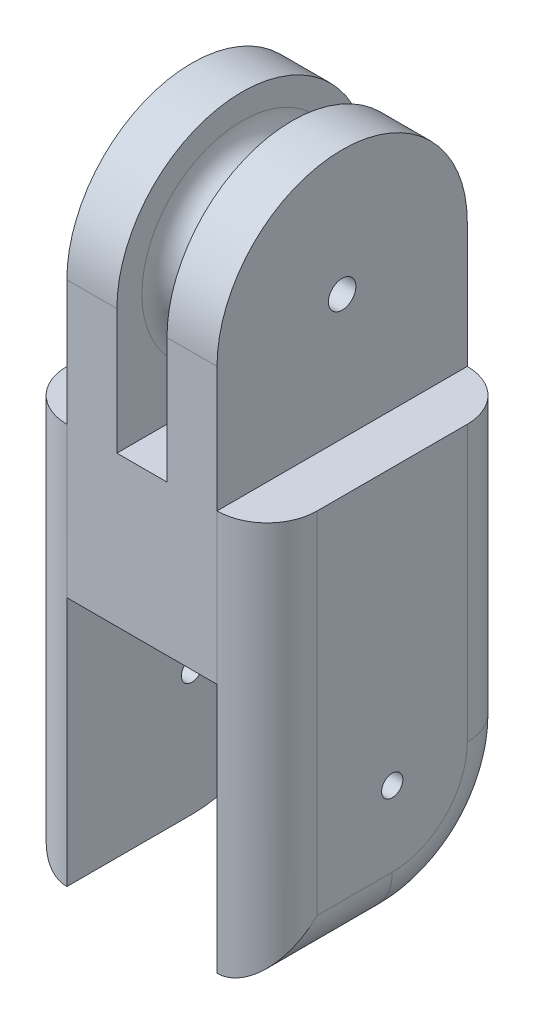
ISO-10303-21;
HEADER;
FILE_DESCRIPTION(('STEP AP214'),'2;1');
FILE_NAME('part.step','',(''),(''),'','','');
FILE_SCHEMA(('AUTOMOTIVE_DESIGN { 1 0 10303 214 1 1 1 1 }'));
ENDSEC;
DATA;
#1=APPLICATION_CONTEXT('core data for automotive mechanical design processes');
#2=APPLICATION_PROTOCOL_DEFINITION('international standard','automotive_design',2000,#1);
#3=PRODUCT_CONTEXT('',#1,'mechanical');
#4=PRODUCT('Part','Part','',(#3));
#5=PRODUCT_RELATED_PRODUCT_CATEGORY('part','',(#4));
#6=PRODUCT_DEFINITION_FORMATION('','',#4);
#7=PRODUCT_DEFINITION_CONTEXT('part definition',#1,'design');
#8=PRODUCT_DEFINITION('design','',#6,#7);
#9=PRODUCT_DEFINITION_SHAPE('','',#8);
#10=(LENGTH_UNIT() NAMED_UNIT(*) SI_UNIT(.MILLI.,.METRE.));
#11=(NAMED_UNIT(*) PLANE_ANGLE_UNIT() SI_UNIT($,.RADIAN.));
#12=(NAMED_UNIT(*) SI_UNIT($,.STERADIAN.) SOLID_ANGLE_UNIT());
#13=UNCERTAINTY_MEASURE_WITH_UNIT(LENGTH_MEASURE(1.E-05),#10,'distance_accuracy_value','');
#14=(GEOMETRIC_REPRESENTATION_CONTEXT(3) GLOBAL_UNCERTAINTY_ASSIGNED_CONTEXT((#13)) GLOBAL_UNIT_ASSIGNED_CONTEXT((#10,
#11,#12)) REPRESENTATION_CONTEXT('',''));
#15=CARTESIAN_POINT('',(0.,0.,0.));
#16=DIRECTION('',(0.,0.,1.));
#17=DIRECTION('',(1.,0.,0.));
#18=AXIS2_PLACEMENT_3D('',#15,#16,#17);
#19=CARTESIAN_POINT('',(0.,12.,0.));
#20=DIRECTION('',(0.,1.,0.));
#21=DIRECTION('',(0.,0.,1.));
#22=AXIS2_PLACEMENT_3D('',#19,#20,#21);
#23=PLANE('',#22);
#24=CARTESIAN_POINT('',(-6.,12.,6.));
#25=DIRECTION('',(0.,1.,0.));
#26=DIRECTION('',(0.,0.,1.));
#27=AXIS2_PLACEMENT_3D('',#24,#25,#26);
#28=CIRCLE('',#27,4.);
#29=CARTESIAN_POINT('',(-10.,12.,6.));
#30=VERTEX_POINT('',#29);
#31=CARTESIAN_POINT('',(-6.,12.,10.));
#32=VERTEX_POINT('',#31);
#33=EDGE_CURVE('E372',#30,#32,#28,.T.);
#34=ORIENTED_EDGE('',*,*,#33,.T.);
#35=DIRECTION('',(0.,0.,1.));
#36=VECTOR('',#35,1.);
#37=CARTESIAN_POINT('',(-6.,12.,10.));
#38=LINE('',#37,#36);
#39=CARTESIAN_POINT('',(-6.,12.,-10.));
#40=VERTEX_POINT('',#39);
#41=EDGE_CURVE('E172',#40,#32,#38,.T.);
#42=ORIENTED_EDGE('',*,*,#41,.F.);
#43=CARTESIAN_POINT('',(-6.,12.,-6.));
#44=DIRECTION('',(0.,1.,0.));
#45=DIRECTION('',(0.,0.,1.));
#46=AXIS2_PLACEMENT_3D('',#43,#44,#45);
#47=CIRCLE('',#46,4.);
#48=CARTESIAN_POINT('',(-10.,12.,-6.));
#49=VERTEX_POINT('',#48);
#50=EDGE_CURVE('E369',#40,#49,#47,.T.);
#51=ORIENTED_EDGE('',*,*,#50,.T.);
#52=DIRECTION('',(0.,0.,1.));
#53=VECTOR('',#52,1.);
#54=CARTESIAN_POINT('',(-10.,12.,-10.));
#55=LINE('',#54,#53);
#56=EDGE_CURVE('E310',#49,#30,#55,.T.);
#57=ORIENTED_EDGE('',*,*,#56,.T.);
#58=EDGE_LOOP('',(#34,#42,#51,#57));
#59=FACE_BOUND('',#58,.T.);
#60=ADVANCED_FACE('F39',(#59),#23,.T.);
#61=CARTESIAN_POINT('',(0.,12.,-6.));
#62=DIRECTION('',(0.,1.,0.));
#63=DIRECTION('',(0.,0.,1.));
#64=AXIS2_PLACEMENT_3D('',#61,#62,#63);
#65=CIRCLE('',#64,0.5);
#66=CARTESIAN_POINT('',(0.,12.,-5.5));
#67=VERTEX_POINT('',#66);
#68=EDGE_CURVE('E426',#67,#67,#65,.F.);
#69=ORIENTED_EDGE('',*,*,#68,.T.);
#70=EDGE_LOOP('',(#69));
#71=FACE_BOUND('',#70,.T.);
#72=CARTESIAN_POINT('',(0.,12.,6.));
#73=DIRECTION('',(0.,1.,0.));
#74=DIRECTION('',(0.,0.,1.));
#75=AXIS2_PLACEMENT_3D('',#72,#73,#74);
#76=CIRCLE('',#75,0.5);
#77=CARTESIAN_POINT('',(0.,12.,6.5));
#78=VERTEX_POINT('',#77);
#79=EDGE_CURVE('E435',#78,#78,#76,.F.);
#80=ORIENTED_EDGE('',*,*,#79,.T.);
#81=EDGE_LOOP('',(#80));
#82=FACE_BOUND('',#81,.T.);
#83=DIRECTION('',(-1.,0.,0.));
#84=VECTOR('',#83,1.);
#85=CARTESIAN_POINT('',(-10.,12.,-10.));
#86=LINE('',#85,#84);
#87=CARTESIAN_POINT('',(2.,12.,-10.));
#88=VERTEX_POINT('',#87);
#89=CARTESIAN_POINT('',(-2.,12.,-10.));
#90=VERTEX_POINT('',#89);
#91=EDGE_CURVE('E322',#88,#90,#86,.T.);
#92=ORIENTED_EDGE('',*,*,#91,.T.);
#93=DIRECTION('',(0.,0.,-1.));
#94=VECTOR('',#93,1.);
#95=CARTESIAN_POINT('',(-2.,12.,10.));
#96=LINE('',#95,#94);
#97=CARTESIAN_POINT('',(-2.,12.,10.));
#98=VERTEX_POINT('',#97);
#99=EDGE_CURVE('E56',#98,#90,#96,.T.);
#100=ORIENTED_EDGE('',*,*,#99,.F.);
#101=DIRECTION('',(1.,0.,0.));
#102=VECTOR('',#101,1.);
#103=CARTESIAN_POINT('',(-10.,12.,10.));
#104=LINE('',#103,#102);
#105=CARTESIAN_POINT('',(2.,12.,10.));
#106=VERTEX_POINT('',#105);
#107=EDGE_CURVE('E314',#98,#106,#104,.T.);
#108=ORIENTED_EDGE('',*,*,#107,.T.);
#109=DIRECTION('',(0.,0.,1.));
#110=VECTOR('',#109,1.);
#111=CARTESIAN_POINT('',(2.,12.,10.));
#112=LINE('',#111,#110);
#113=EDGE_CURVE('E231',#88,#106,#112,.T.);
#114=ORIENTED_EDGE('',*,*,#113,.F.);
#115=EDGE_LOOP('',(#92,#100,#108,#114));
#116=FACE_BOUND('',#115,.T.);
#117=ADVANCED_FACE('F512',(#71,#82,#116),#23,.T.);
#118=DIRECTION('',(0.,0.,-1.));
#119=VECTOR('',#118,1.);
#120=CARTESIAN_POINT('',(6.,12.,10.));
#121=LINE('',#120,#119);
#122=CARTESIAN_POINT('',(6.,12.,10.));
#123=VERTEX_POINT('',#122);
#124=CARTESIAN_POINT('',(6.,12.,-10.));
#125=VERTEX_POINT('',#124);
#126=EDGE_CURVE('E176',#123,#125,#121,.T.);
#127=ORIENTED_EDGE('',*,*,#126,.F.);
#128=CARTESIAN_POINT('',(6.,12.,6.));
#129=DIRECTION('',(0.,1.,0.));
#130=DIRECTION('',(0.,0.,1.));
#131=AXIS2_PLACEMENT_3D('',#128,#129,#130);
#132=CIRCLE('',#131,4.);
#133=CARTESIAN_POINT('',(10.,12.,6.));
#134=VERTEX_POINT('',#133);
#135=EDGE_CURVE('E375',#123,#134,#132,.T.);
#136=ORIENTED_EDGE('',*,*,#135,.T.);
#137=DIRECTION('',(0.,0.,-1.));
#138=VECTOR('',#137,1.);
#139=CARTESIAN_POINT('',(10.,12.,-10.));
#140=LINE('',#139,#138);
#141=CARTESIAN_POINT('',(10.,12.,-6.));
#142=VERTEX_POINT('',#141);
#143=EDGE_CURVE('E318',#134,#142,#140,.T.);
#144=ORIENTED_EDGE('',*,*,#143,.T.);
#145=CARTESIAN_POINT('',(6.,12.,-6.));
#146=DIRECTION('',(0.,1.,0.));
#147=DIRECTION('',(0.,0.,1.));
#148=AXIS2_PLACEMENT_3D('',#145,#146,#147);
#149=CIRCLE('',#148,4.);
#150=EDGE_CURVE('E365',#142,#125,#149,.T.);
#151=ORIENTED_EDGE('',*,*,#150,.T.);
#152=EDGE_LOOP('',(#127,#136,#144,#151));
#153=FACE_BOUND('',#152,.T.);
#154=ADVANCED_FACE('F448',(#153),#23,.T.);
#155=CARTESIAN_POINT('',(0.,0.,0.));
#156=DIRECTION('',(0.,1.,0.));
#157=DIRECTION('',(0.,0.,1.));
#158=AXIS2_PLACEMENT_3D('',#155,#156,#157);
#159=PLANE('',#158);
#160=CARTESIAN_POINT('',(0.,0.,-6.));
#161=DIRECTION('',(0.,-1.,0.));
#162=DIRECTION('',(0.,0.,-1.));
#163=AXIS2_PLACEMENT_3D('',#160,#161,#162);
#164=CIRCLE('',#163,0.5);
#165=CARTESIAN_POINT('',(0.,0.,-6.5));
#166=VERTEX_POINT('',#165);
#167=EDGE_CURVE('E420',#166,#166,#164,.T.);
#168=ORIENTED_EDGE('',*,*,#167,.F.);
#169=EDGE_LOOP('',(#168));
#170=FACE_BOUND('',#169,.T.);
#171=CARTESIAN_POINT('',(0.,0.,6.));
#172=DIRECTION('',(0.,-1.,0.));
#173=DIRECTION('',(0.,0.,1.));
#174=AXIS2_PLACEMENT_3D('',#171,#172,#173);
#175=CIRCLE('',#174,0.5);
#176=CARTESIAN_POINT('',(0.,0.,6.5));
#177=VERTEX_POINT('',#176);
#178=EDGE_CURVE('E432',#177,#177,#175,.T.);
#179=ORIENTED_EDGE('',*,*,#178,.F.);
#180=EDGE_LOOP('',(#179));
#181=FACE_BOUND('',#180,.T.);
#182=DIRECTION('',(0.,0.,-1.));
#183=VECTOR('',#182,1.);
#184=CARTESIAN_POINT('',(6.,0.,-10.));
#185=LINE('',#184,#183);
#186=CARTESIAN_POINT('',(6.,0.,10.));
#187=VERTEX_POINT('',#186);
#188=CARTESIAN_POINT('',(6.,0.,-10.));
#189=VERTEX_POINT('',#188);
#190=EDGE_CURVE('E286',#187,#189,#185,.T.);
#191=ORIENTED_EDGE('',*,*,#190,.F.);
#192=DIRECTION('',(1.,0.,0.));
#193=VECTOR('',#192,1.);
#194=CARTESIAN_POINT('',(-10.,0.,10.));
#195=LINE('',#194,#193);
#196=CARTESIAN_POINT('',(-6.,0.,10.));
#197=VERTEX_POINT('',#196);
#198=EDGE_CURVE('E309',#197,#187,#195,.T.);
#199=ORIENTED_EDGE('',*,*,#198,.F.);
#200=DIRECTION('',(0.,0.,1.));
#201=VECTOR('',#200,1.);
#202=CARTESIAN_POINT('',(-6.,0.,10.));
#203=LINE('',#202,#201);
#204=CARTESIAN_POINT('',(-6.,0.,-10.));
#205=VERTEX_POINT('',#204);
#206=EDGE_CURVE('E297',#205,#197,#203,.T.);
#207=ORIENTED_EDGE('',*,*,#206,.F.);
#208=DIRECTION('',(-1.,0.,0.));
#209=VECTOR('',#208,1.);
#210=CARTESIAN_POINT('',(-10.,0.,-10.));
#211=LINE('',#210,#209);
#212=EDGE_CURVE('E315',#189,#205,#211,.T.);
#213=ORIENTED_EDGE('',*,*,#212,.F.);
#214=EDGE_LOOP('',(#191,#199,#207,#213));
#215=FACE_BOUND('',#214,.T.);
#216=ADVANCED_FACE('F444',(#170,#181,#215),#159,.F.);
#217=CARTESIAN_POINT('',(-10.,12.,-10.));
#218=DIRECTION('',(1.,0.,0.));
#219=DIRECTION('',(0.,0.,-1.));
#220=AXIS2_PLACEMENT_3D('',#217,#218,#219);
#221=PLANE('',#220);
#222=CARTESIAN_POINT('',(-10.,-10.,0.));
#223=DIRECTION('',(-1.,0.,0.));
#224=DIRECTION('',(0.,0.,1.));
#225=AXIS2_PLACEMENT_3D('',#222,#223,#224);
#226=CIRCLE('',#225,0.85);
#227=CARTESIAN_POINT('',(-10.,-10.,0.850000000000001));
#228=VERTEX_POINT('',#227);
#229=EDGE_CURVE('E261',#228,#228,#226,.T.);
#230=ORIENTED_EDGE('',*,*,#229,.F.);
#231=EDGE_LOOP('',(#230));
#232=FACE_BOUND('',#231,.T.);
#233=DIRECTION('',(0.,0.,1.));
#234=VECTOR('',#233,1.);
#235=CARTESIAN_POINT('',(-10.,-16.,10.));
#236=LINE('',#235,#234);
#237=CARTESIAN_POINT('',(-10.,-16.,0.));
#238=VERTEX_POINT('',#237);
#239=CARTESIAN_POINT('',(-10.,-16.,6.));
#240=VERTEX_POINT('',#239);
#241=EDGE_CURVE('E338',#238,#240,#236,.T.);
#242=ORIENTED_EDGE('',*,*,#241,.T.);
#243=DIRECTION('',(0.,-1.,0.));
#244=VECTOR('',#243,1.);
#245=CARTESIAN_POINT('',(-10.,12.,6.));
#246=LINE('',#245,#244);
#247=EDGE_CURVE('E342',#240,#30,#246,.F.);
#248=ORIENTED_EDGE('',*,*,#247,.T.);
#249=ORIENTED_EDGE('',*,*,#56,.F.);
#250=DIRECTION('',(0.,-1.,0.));
#251=VECTOR('',#250,1.);
#252=CARTESIAN_POINT('',(-10.,12.,-6.));
#253=LINE('',#252,#251);
#254=CARTESIAN_POINT('',(-10.,-10.,-6.));
#255=VERTEX_POINT('',#254);
#256=EDGE_CURVE('E325',#49,#255,#253,.T.);
#257=ORIENTED_EDGE('',*,*,#256,.T.);
#258=CARTESIAN_POINT('',(-10.,-10.,0.));
#259=DIRECTION('',(1.,0.,0.));
#260=DIRECTION('',(0.,0.,-1.));
#261=AXIS2_PLACEMENT_3D('',#258,#259,#260);
#262=CIRCLE('',#261,6.);
#263=EDGE_CURVE('E335',#255,#238,#262,.F.);
#264=ORIENTED_EDGE('',*,*,#263,.T.);
#265=EDGE_LOOP('',(#242,#248,#249,#257,#264));
#266=FACE_BOUND('',#265,.T.);
#267=ADVANCED_FACE('F447',(#232,#266),#221,.F.);
#268=CARTESIAN_POINT('',(-10.,12.,10.));
#269=DIRECTION('',(0.,0.,-1.));
#270=DIRECTION('',(-1.,0.,0.));
#271=AXIS2_PLACEMENT_3D('',#268,#269,#270);
#272=PLANE('',#271);
#273=ORIENTED_EDGE('',*,*,#198,.T.);
#274=DIRECTION('',(0.,-1.,0.));
#275=VECTOR('',#274,1.);
#276=CARTESIAN_POINT('',(6.,12.,10.));
#277=LINE('',#276,#275);
#278=EDGE_CURVE('E361',#187,#123,#277,.F.);
#279=ORIENTED_EDGE('',*,*,#278,.T.);
#280=DIRECTION('',(0.,-1.,0.));
#281=VECTOR('',#280,1.);
#282=CARTESIAN_POINT('',(6.,22.,10.));
#283=LINE('',#282,#281);
#284=CARTESIAN_POINT('',(6.,22.,10.));
#285=VERTEX_POINT('',#284);
#286=EDGE_CURVE('E235',#285,#123,#283,.T.);
#287=ORIENTED_EDGE('',*,*,#286,.F.);
#288=DIRECTION('',(1.,0.,0.));
#289=VECTOR('',#288,1.);
#290=CARTESIAN_POINT('',(6.,22.,10.));
#291=LINE('',#290,#289);
#292=CARTESIAN_POINT('',(2.,22.,10.));
#293=VERTEX_POINT('',#292);
#294=EDGE_CURVE('E230',#293,#285,#291,.T.);
#295=ORIENTED_EDGE('',*,*,#294,.F.);
#296=DIRECTION('',(0.,-1.,0.));
#297=VECTOR('',#296,1.);
#298=CARTESIAN_POINT('',(2.,22.,10.));
#299=LINE('',#298,#297);
#300=EDGE_CURVE('E243',#293,#106,#299,.T.);
#301=ORIENTED_EDGE('',*,*,#300,.T.);
#302=ORIENTED_EDGE('',*,*,#107,.F.);
#303=DIRECTION('',(0.,-1.,0.));
#304=VECTOR('',#303,1.);
#305=CARTESIAN_POINT('',(-2.,22.,10.));
#306=LINE('',#305,#304);
#307=CARTESIAN_POINT('',(-2.,22.,10.));
#308=VERTEX_POINT('',#307);
#309=EDGE_CURVE('E177',#308,#98,#306,.T.);
#310=ORIENTED_EDGE('',*,*,#309,.F.);
#311=DIRECTION('',(1.,0.,0.));
#312=VECTOR('',#311,1.);
#313=CARTESIAN_POINT('',(-6.,22.,10.));
#314=LINE('',#313,#312);
#315=CARTESIAN_POINT('',(-6.,22.,10.));
#316=VERTEX_POINT('',#315);
#317=EDGE_CURVE('E180',#316,#308,#314,.T.);
#318=ORIENTED_EDGE('',*,*,#317,.F.);
#319=DIRECTION('',(0.,-1.,0.));
#320=VECTOR('',#319,1.);
#321=CARTESIAN_POINT('',(-6.,22.,10.));
#322=LINE('',#321,#320);
#323=EDGE_CURVE('E165',#316,#32,#322,.T.);
#324=ORIENTED_EDGE('',*,*,#323,.T.);
#325=DIRECTION('',(0.,-1.,0.));
#326=VECTOR('',#325,1.);
#327=CARTESIAN_POINT('',(-6.,12.,10.));
#328=LINE('',#327,#326);
#329=EDGE_CURVE('E358',#32,#197,#328,.T.);
#330=ORIENTED_EDGE('',*,*,#329,.T.);
#331=EDGE_LOOP('',(#273,#279,#287,#295,#301,#302,#310,#318,#324,#330));
#332=FACE_BOUND('',#331,.T.);
#333=ADVANCED_FACE('F182',(#332),#272,.F.);
#334=CARTESIAN_POINT('',(10.,12.,-10.));
#335=DIRECTION('',(-1.,0.,0.));
#336=DIRECTION('',(0.,0.,1.));
#337=AXIS2_PLACEMENT_3D('',#334,#335,#336);
#338=PLANE('',#337);
#339=CARTESIAN_POINT('',(10.,-10.,0.));
#340=DIRECTION('',(-1.,0.,0.));
#341=DIRECTION('',(0.,0.,1.));
#342=AXIS2_PLACEMENT_3D('',#339,#340,#341);
#343=CIRCLE('',#342,0.85);
#344=CARTESIAN_POINT('',(10.,-10.,0.849999999999999));
#345=VERTEX_POINT('',#344);
#346=EDGE_CURVE('E256',#345,#345,#343,.T.);
#347=ORIENTED_EDGE('',*,*,#346,.T.);
#348=EDGE_LOOP('',(#347));
#349=FACE_BOUND('',#348,.T.);
#350=ORIENTED_EDGE('',*,*,#143,.F.);
#351=DIRECTION('',(0.,-1.,0.));
#352=VECTOR('',#351,1.);
#353=CARTESIAN_POINT('',(10.,12.,6.));
#354=LINE('',#353,#352);
#355=CARTESIAN_POINT('',(10.,-16.,6.));
#356=VERTEX_POINT('',#355);
#357=EDGE_CURVE('E355',#134,#356,#354,.T.);
#358=ORIENTED_EDGE('',*,*,#357,.T.);
#359=DIRECTION('',(0.,0.,-1.));
#360=VECTOR('',#359,1.);
#361=CARTESIAN_POINT('',(10.,-16.,0.));
#362=LINE('',#361,#360);
#363=CARTESIAN_POINT('',(10.,-16.,0.));
#364=VERTEX_POINT('',#363);
#365=EDGE_CURVE('E351',#356,#364,#362,.T.);
#366=ORIENTED_EDGE('',*,*,#365,.T.);
#367=CARTESIAN_POINT('',(10.,-10.,0.));
#368=DIRECTION('',(-1.,0.,0.));
#369=DIRECTION('',(0.,0.,1.));
#370=AXIS2_PLACEMENT_3D('',#367,#368,#369);
#371=CIRCLE('',#370,6.);
#372=CARTESIAN_POINT('',(10.,-10.,-6.));
#373=VERTEX_POINT('',#372);
#374=EDGE_CURVE('E348',#364,#373,#371,.F.);
#375=ORIENTED_EDGE('',*,*,#374,.T.);
#376=DIRECTION('',(0.,-1.,0.));
#377=VECTOR('',#376,1.);
#378=CARTESIAN_POINT('',(10.,12.,-6.));
#379=LINE('',#378,#377);
#380=EDGE_CURVE('E345',#373,#142,#379,.F.);
#381=ORIENTED_EDGE('',*,*,#380,.T.);
#382=EDGE_LOOP('',(#350,#358,#366,#375,#381));
#383=FACE_BOUND('',#382,.T.);
#384=ADVANCED_FACE('F507',(#349,#383),#338,.F.);
#385=CARTESIAN_POINT('',(-10.,12.,-10.));
#386=DIRECTION('',(0.,0.,1.));
#387=DIRECTION('',(1.,0.,0.));
#388=AXIS2_PLACEMENT_3D('',#385,#386,#387);
#389=PLANE('',#388);
#390=ORIENTED_EDGE('',*,*,#212,.T.);
#391=DIRECTION('',(0.,-1.,0.));
#392=VECTOR('',#391,1.);
#393=CARTESIAN_POINT('',(-6.,12.,-10.));
#394=LINE('',#393,#392);
#395=EDGE_CURVE('E381',#205,#40,#394,.F.);
#396=ORIENTED_EDGE('',*,*,#395,.T.);
#397=DIRECTION('',(0.,-1.,0.));
#398=VECTOR('',#397,1.);
#399=CARTESIAN_POINT('',(-6.,22.,-10.));
#400=LINE('',#399,#398);
#401=CARTESIAN_POINT('',(-6.,22.,-10.));
#402=VERTEX_POINT('',#401);
#403=EDGE_CURVE('E213',#402,#40,#400,.T.);
#404=ORIENTED_EDGE('',*,*,#403,.F.);
#405=DIRECTION('',(-1.,0.,0.));
#406=VECTOR('',#405,1.);
#407=CARTESIAN_POINT('',(-6.,22.,-10.));
#408=LINE('',#407,#406);
#409=CARTESIAN_POINT('',(-2.,22.,-10.));
#410=VERTEX_POINT('',#409);
#411=EDGE_CURVE('E187',#410,#402,#408,.T.);
#412=ORIENTED_EDGE('',*,*,#411,.F.);
#413=DIRECTION('',(0.,-1.,0.));
#414=VECTOR('',#413,1.);
#415=CARTESIAN_POINT('',(-2.,22.,-10.));
#416=LINE('',#415,#414);
#417=EDGE_CURVE('E220',#410,#90,#416,.T.);
#418=ORIENTED_EDGE('',*,*,#417,.T.);
#419=ORIENTED_EDGE('',*,*,#91,.F.);
#420=DIRECTION('',(0.,-1.,0.));
#421=VECTOR('',#420,1.);
#422=CARTESIAN_POINT('',(2.,22.,-10.));
#423=LINE('',#422,#421);
#424=CARTESIAN_POINT('',(2.,22.,-10.));
#425=VERTEX_POINT('',#424);
#426=EDGE_CURVE('E247',#425,#88,#423,.T.);
#427=ORIENTED_EDGE('',*,*,#426,.F.);
#428=DIRECTION('',(-1.,0.,0.));
#429=VECTOR('',#428,1.);
#430=CARTESIAN_POINT('',(6.,22.,-10.));
#431=LINE('',#430,#429);
#432=CARTESIAN_POINT('',(6.,22.,-10.));
#433=VERTEX_POINT('',#432);
#434=EDGE_CURVE('E226',#433,#425,#431,.T.);
#435=ORIENTED_EDGE('',*,*,#434,.F.);
#436=DIRECTION('',(0.,-1.,0.));
#437=VECTOR('',#436,1.);
#438=CARTESIAN_POINT('',(6.,22.,-10.));
#439=LINE('',#438,#437);
#440=EDGE_CURVE('E251',#433,#125,#439,.T.);
#441=ORIENTED_EDGE('',*,*,#440,.T.);
#442=DIRECTION('',(0.,-1.,0.));
#443=VECTOR('',#442,1.);
#444=CARTESIAN_POINT('',(6.,12.,-10.));
#445=LINE('',#444,#443);
#446=EDGE_CURVE('E378',#125,#189,#445,.T.);
#447=ORIENTED_EDGE('',*,*,#446,.T.);
#448=EDGE_LOOP('',(#390,#396,#404,#412,#418,#419,#427,#435,#441,#447));
#449=FACE_BOUND('',#448,.T.);
#450=ADVANCED_FACE('F477',(#449),#389,.F.);
#451=CARTESIAN_POINT('',(-6.,-10.,10.));
#452=DIRECTION('',(-1.,0.,0.));
#453=DIRECTION('',(0.,0.,1.));
#454=AXIS2_PLACEMENT_3D('',#451,#452,#453);
#455=PLANE('',#454);
#456=CARTESIAN_POINT('',(-6.,-10.,0.));
#457=DIRECTION('',(-1.,0.,0.));
#458=DIRECTION('',(0.,0.,1.));
#459=AXIS2_PLACEMENT_3D('',#456,#457,#458);
#460=CIRCLE('',#459,0.85);
#461=CARTESIAN_POINT('',(-6.,-10.,0.850000000000001));
#462=VERTEX_POINT('',#461);
#463=EDGE_CURVE('E266',#462,#462,#460,.T.);
#464=ORIENTED_EDGE('',*,*,#463,.T.);
#465=EDGE_LOOP('',(#464));
#466=FACE_BOUND('',#465,.T.);
#467=ORIENTED_EDGE('',*,*,#206,.T.);
#468=DIRECTION('',(0.,1.,0.));
#469=VECTOR('',#468,1.);
#470=CARTESIAN_POINT('',(-6.,-10.,10.));
#471=LINE('',#470,#469);
#472=CARTESIAN_POINT('',(-6.,-20.,10.));
#473=VERTEX_POINT('',#472);
#474=EDGE_CURVE('E301',#473,#197,#471,.T.);
#475=ORIENTED_EDGE('',*,*,#474,.F.);
#476=DIRECTION('',(0.,0.,1.));
#477=VECTOR('',#476,1.);
#478=CARTESIAN_POINT('',(-6.,-20.,0.));
#479=LINE('',#478,#477);
#480=CARTESIAN_POINT('',(-6.,-20.,0.));
#481=VERTEX_POINT('',#480);
#482=EDGE_CURVE('E282',#481,#473,#479,.T.);
#483=ORIENTED_EDGE('',*,*,#482,.F.);
#484=CARTESIAN_POINT('',(-6.,-10.,0.));
#485=DIRECTION('',(-1.,0.,0.));
#486=DIRECTION('',(0.,0.,1.));
#487=AXIS2_PLACEMENT_3D('',#484,#485,#486);
#488=CIRCLE('',#487,10.);
#489=CARTESIAN_POINT('',(-6.,-10.,-10.));
#490=VERTEX_POINT('',#489);
#491=EDGE_CURVE('E278',#490,#481,#488,.T.);
#492=ORIENTED_EDGE('',*,*,#491,.F.);
#493=DIRECTION('',(0.,1.,0.));
#494=VECTOR('',#493,1.);
#495=CARTESIAN_POINT('',(-6.,-10.,-10.));
#496=LINE('',#495,#494);
#497=EDGE_CURVE('E305',#490,#205,#496,.T.);
#498=ORIENTED_EDGE('',*,*,#497,.T.);
#499=EDGE_LOOP('',(#467,#475,#483,#492,#498));
#500=FACE_BOUND('',#499,.T.);
#501=ADVANCED_FACE('F489',(#466,#500),#455,.F.);
#502=CARTESIAN_POINT('',(6.,-10.,-10.));
#503=DIRECTION('',(1.,0.,0.));
#504=DIRECTION('',(0.,0.,-1.));
#505=AXIS2_PLACEMENT_3D('',#502,#503,#504);
#506=PLANE('',#505);
#507=CARTESIAN_POINT('',(6.,-10.,0.));
#508=DIRECTION('',(1.,0.,0.));
#509=DIRECTION('',(0.,0.,-1.));
#510=AXIS2_PLACEMENT_3D('',#507,#508,#509);
#511=CIRCLE('',#510,0.85);
#512=CARTESIAN_POINT('',(6.,-10.,-0.850000000000001));
#513=VERTEX_POINT('',#512);
#514=EDGE_CURVE('E260',#513,#513,#511,.T.);
#515=ORIENTED_EDGE('',*,*,#514,.T.);
#516=EDGE_LOOP('',(#515));
#517=FACE_BOUND('',#516,.T.);
#518=ORIENTED_EDGE('',*,*,#190,.T.);
#519=DIRECTION('',(0.,1.,0.));
#520=VECTOR('',#519,1.);
#521=CARTESIAN_POINT('',(6.,-10.,-10.));
#522=LINE('',#521,#520);
#523=CARTESIAN_POINT('',(6.,-10.,-10.));
#524=VERTEX_POINT('',#523);
#525=EDGE_CURVE('E290',#524,#189,#522,.T.);
#526=ORIENTED_EDGE('',*,*,#525,.F.);
#527=CARTESIAN_POINT('',(6.,-10.,0.));
#528=DIRECTION('',(1.,0.,0.));
#529=DIRECTION('',(0.,0.,-1.));
#530=AXIS2_PLACEMENT_3D('',#527,#528,#529);
#531=CIRCLE('',#530,10.);
#532=CARTESIAN_POINT('',(6.,-20.,0.));
#533=VERTEX_POINT('',#532);
#534=EDGE_CURVE('E274',#533,#524,#531,.T.);
#535=ORIENTED_EDGE('',*,*,#534,.F.);
#536=DIRECTION('',(0.,0.,-1.));
#537=VECTOR('',#536,1.);
#538=CARTESIAN_POINT('',(6.,-20.,0.));
#539=LINE('',#538,#537);
#540=CARTESIAN_POINT('',(6.,-20.,9.99999999999999));
#541=VERTEX_POINT('',#540);
#542=EDGE_CURVE('E270',#541,#533,#539,.T.);
#543=ORIENTED_EDGE('',*,*,#542,.F.);
#544=DIRECTION('',(0.,1.,0.));
#545=VECTOR('',#544,1.);
#546=CARTESIAN_POINT('',(6.,-10.,10.));
#547=LINE('',#546,#545);
#548=EDGE_CURVE('E294',#541,#187,#547,.T.);
#549=ORIENTED_EDGE('',*,*,#548,.T.);
#550=EDGE_LOOP('',(#518,#526,#535,#543,#549));
#551=FACE_BOUND('',#550,.T.);
#552=ADVANCED_FACE('F528',(#517,#551),#506,.F.);
#553=CARTESIAN_POINT('',(10.,-10.,0.));
#554=DIRECTION('',(-1.,0.,0.));
#555=DIRECTION('',(0.,0.,1.));
#556=AXIS2_PLACEMENT_3D('',#553,#554,#555);
#557=CYLINDRICAL_SURFACE('',#556,0.85);
#558=ORIENTED_EDGE('',*,*,#346,.F.);
#559=EDGE_LOOP('',(#558));
#560=FACE_BOUND('',#559,.T.);
#561=ORIENTED_EDGE('',*,*,#514,.F.);
#562=EDGE_LOOP('',(#561));
#563=FACE_BOUND('',#562,.T.);
#564=ADVANCED_FACE('F546',(#560,#563),#557,.F.);
#565=ORIENTED_EDGE('',*,*,#229,.T.);
#566=EDGE_LOOP('',(#565));
#567=FACE_BOUND('',#566,.T.);
#568=ORIENTED_EDGE('',*,*,#463,.F.);
#569=EDGE_LOOP('',(#568));
#570=FACE_BOUND('',#569,.T.);
#571=ADVANCED_FACE('F549',(#567,#570),#557,.F.);
#572=CARTESIAN_POINT('',(-6.,12.,-6.));
#573=DIRECTION('',(0.,-1.,0.));
#574=DIRECTION('',(0.,0.,-1.));
#575=AXIS2_PLACEMENT_3D('',#572,#573,#574);
#576=CYLINDRICAL_SURFACE('',#575,4.);
#577=ORIENTED_EDGE('',*,*,#395,.F.);
#578=ORIENTED_EDGE('',*,*,#497,.F.);
#579=CARTESIAN_POINT('',(-6.,-10.,-6.));
#580=DIRECTION('',(0.,-1.,0.));
#581=DIRECTION('',(0.,0.,-1.));
#582=AXIS2_PLACEMENT_3D('',#579,#580,#581);
#583=CIRCLE('',#582,4.);
#584=EDGE_CURVE('E265',#255,#490,#583,.T.);
#585=ORIENTED_EDGE('',*,*,#584,.F.);
#586=ORIENTED_EDGE('',*,*,#256,.F.);
#587=ORIENTED_EDGE('',*,*,#50,.F.);
#588=EDGE_LOOP('',(#577,#578,#585,#586,#587));
#589=FACE_BOUND('',#588,.T.);
#590=ADVANCED_FACE('F498',(#589),#576,.T.);
#591=CARTESIAN_POINT('',(-6.,-10.,0.));
#592=DIRECTION('',(1.,0.,0.));
#593=DIRECTION('',(0.,0.,-1.));
#594=AXIS2_PLACEMENT_3D('',#591,#592,#593);
#595=TOROIDAL_SURFACE('',#594,6.,4.);
#596=ORIENTED_EDGE('',*,*,#584,.T.);
#597=ORIENTED_EDGE('',*,*,#491,.T.);
#598=CARTESIAN_POINT('',(-6.,-16.,0.));
#599=DIRECTION('',(0.,0.,1.));
#600=DIRECTION('',(1.,0.,0.));
#601=AXIS2_PLACEMENT_3D('',#598,#599,#600);
#602=CIRCLE('',#601,4.);
#603=EDGE_CURVE('E388',#238,#481,#602,.T.);
#604=ORIENTED_EDGE('',*,*,#603,.F.);
#605=ORIENTED_EDGE('',*,*,#263,.F.);
#606=EDGE_LOOP('',(#596,#597,#604,#605));
#607=FACE_BOUND('',#606,.T.);
#608=ADVANCED_FACE('F496',(#607),#595,.T.);
#609=CARTESIAN_POINT('',(-6.,12.,6.));
#610=DIRECTION('',(0.,-1.,0.));
#611=DIRECTION('',(0.,0.,-1.));
#612=AXIS2_PLACEMENT_3D('',#609,#610,#611);
#613=CYLINDRICAL_SURFACE('',#612,4.);
#614=ORIENTED_EDGE('',*,*,#33,.F.);
#615=ORIENTED_EDGE('',*,*,#247,.F.);
#616=CARTESIAN_POINT('',(-6.,-16.,6.));
#617=DIRECTION('',(0.,-0.707106781186547,-0.707106781186547));
#618=DIRECTION('',(0.,-0.707106781186547,0.707106781186547));
#619=AXIS2_PLACEMENT_3D('',#616,#617,#618);
#620=ELLIPSE('',#619,5.65685424949238,4.);
#621=EDGE_CURVE('E385',#473,#240,#620,.T.);
#622=ORIENTED_EDGE('',*,*,#621,.F.);
#623=ORIENTED_EDGE('',*,*,#474,.T.);
#624=ORIENTED_EDGE('',*,*,#329,.F.);
#625=EDGE_LOOP('',(#614,#615,#622,#623,#624));
#626=FACE_BOUND('',#625,.T.);
#627=ADVANCED_FACE('F486',(#626),#613,.T.);
#628=CARTESIAN_POINT('',(-6.,-16.,-10.));
#629=DIRECTION('',(0.,0.,-1.));
#630=DIRECTION('',(-1.,0.,0.));
#631=AXIS2_PLACEMENT_3D('',#628,#629,#630);
#632=CYLINDRICAL_SURFACE('',#631,4.);
#633=ORIENTED_EDGE('',*,*,#603,.T.);
#634=ORIENTED_EDGE('',*,*,#482,.T.);
#635=ORIENTED_EDGE('',*,*,#621,.T.);
#636=ORIENTED_EDGE('',*,*,#241,.F.);
#637=EDGE_LOOP('',(#633,#634,#635,#636));
#638=FACE_BOUND('',#637,.T.);
#639=ADVANCED_FACE('F491',(#638),#632,.T.);
#640=CARTESIAN_POINT('',(6.,12.,-6.));
#641=DIRECTION('',(0.,-1.,0.));
#642=DIRECTION('',(0.,0.,-1.));
#643=AXIS2_PLACEMENT_3D('',#640,#641,#642);
#644=CYLINDRICAL_SURFACE('',#643,4.);
#645=ORIENTED_EDGE('',*,*,#150,.F.);
#646=ORIENTED_EDGE('',*,*,#380,.F.);
#647=CARTESIAN_POINT('',(6.,-10.,-6.));
#648=DIRECTION('',(0.,-1.,0.));
#649=DIRECTION('',(0.,0.,-1.));
#650=AXIS2_PLACEMENT_3D('',#647,#648,#649);
#651=CIRCLE('',#650,4.);
#652=EDGE_CURVE('E389',#524,#373,#651,.T.);
#653=ORIENTED_EDGE('',*,*,#652,.F.);
#654=ORIENTED_EDGE('',*,*,#525,.T.);
#655=ORIENTED_EDGE('',*,*,#446,.F.);
#656=EDGE_LOOP('',(#645,#646,#653,#654,#655));
#657=FACE_BOUND('',#656,.T.);
#658=ADVANCED_FACE('F526',(#657),#644,.T.);
#659=CARTESIAN_POINT('',(6.,12.,6.));
#660=DIRECTION('',(0.,-1.,0.));
#661=DIRECTION('',(0.,0.,-1.));
#662=AXIS2_PLACEMENT_3D('',#659,#660,#661);
#663=CYLINDRICAL_SURFACE('',#662,4.);
#664=ORIENTED_EDGE('',*,*,#278,.F.);
#665=ORIENTED_EDGE('',*,*,#548,.F.);
#666=CARTESIAN_POINT('',(6.,-16.,6.));
#667=DIRECTION('',(0.,-0.707106781186547,-0.707106781186547));
#668=DIRECTION('',(0.,-0.707106781186547,0.707106781186547));
#669=AXIS2_PLACEMENT_3D('',#666,#667,#668);
#670=ELLIPSE('',#669,5.65685424949238,4.);
#671=EDGE_CURVE('E398',#356,#541,#670,.T.);
#672=ORIENTED_EDGE('',*,*,#671,.F.);
#673=ORIENTED_EDGE('',*,*,#357,.F.);
#674=ORIENTED_EDGE('',*,*,#135,.F.);
#675=EDGE_LOOP('',(#664,#665,#672,#673,#674));
#676=FACE_BOUND('',#675,.T.);
#677=ADVANCED_FACE('F461',(#676),#663,.T.);
#678=CARTESIAN_POINT('',(6.,-10.,0.));
#679=DIRECTION('',(-1.,0.,0.));
#680=DIRECTION('',(0.,0.,1.));
#681=AXIS2_PLACEMENT_3D('',#678,#679,#680);
#682=TOROIDAL_SURFACE('',#681,6.,4.);
#683=ORIENTED_EDGE('',*,*,#652,.T.);
#684=ORIENTED_EDGE('',*,*,#374,.F.);
#685=CARTESIAN_POINT('',(6.,-16.,0.));
#686=DIRECTION('',(0.,0.,1.));
#687=DIRECTION('',(1.,0.,0.));
#688=AXIS2_PLACEMENT_3D('',#685,#686,#687);
#689=CIRCLE('',#688,4.);
#690=EDGE_CURVE('E255',#533,#364,#689,.T.);
#691=ORIENTED_EDGE('',*,*,#690,.F.);
#692=ORIENTED_EDGE('',*,*,#534,.T.);
#693=EDGE_LOOP('',(#683,#684,#691,#692));
#694=FACE_BOUND('',#693,.T.);
#695=ADVANCED_FACE('F535',(#694),#682,.T.);
#696=CARTESIAN_POINT('',(6.,-16.,-10.));
#697=DIRECTION('',(0.,0.,1.));
#698=DIRECTION('',(1.,0.,0.));
#699=AXIS2_PLACEMENT_3D('',#696,#697,#698);
#700=CYLINDRICAL_SURFACE('',#699,4.);
#701=ORIENTED_EDGE('',*,*,#671,.T.);
#702=ORIENTED_EDGE('',*,*,#542,.T.);
#703=ORIENTED_EDGE('',*,*,#690,.T.);
#704=ORIENTED_EDGE('',*,*,#365,.F.);
#705=EDGE_LOOP('',(#701,#702,#703,#704));
#706=FACE_BOUND('',#705,.T.);
#707=ADVANCED_FACE('F532',(#706),#700,.T.);
#708=CARTESIAN_POINT('',(6.,22.,10.));
#709=DIRECTION('',(-1.,0.,0.));
#710=DIRECTION('',(0.,0.,1.));
#711=AXIS2_PLACEMENT_3D('',#708,#709,#710);
#712=PLANE('',#711);
#713=CARTESIAN_POINT('',(6.,22.,0.));
#714=DIRECTION('',(-1.,0.,0.));
#715=DIRECTION('',(0.,0.,1.));
#716=AXIS2_PLACEMENT_3D('',#713,#714,#715);
#717=CIRCLE('',#716,1.1);
#718=CARTESIAN_POINT('',(6.,22.,1.1));
#719=VERTEX_POINT('',#718);
#720=EDGE_CURVE('E194',#719,#719,#717,.T.);
#721=ORIENTED_EDGE('',*,*,#720,.T.);
#722=EDGE_LOOP('',(#721));
#723=FACE_BOUND('',#722,.T.);
#724=ORIENTED_EDGE('',*,*,#126,.T.);
#725=ORIENTED_EDGE('',*,*,#440,.F.);
#726=CARTESIAN_POINT('',(6.,22.,0.));
#727=DIRECTION('',(1.,0.,0.));
#728=DIRECTION('',(0.,0.,-1.));
#729=AXIS2_PLACEMENT_3D('',#726,#727,#728);
#730=CIRCLE('',#729,10.);
#731=EDGE_CURVE('E198',#433,#285,#730,.T.);
#732=ORIENTED_EDGE('',*,*,#731,.T.);
#733=ORIENTED_EDGE('',*,*,#286,.T.);
#734=EDGE_LOOP('',(#724,#725,#732,#733));
#735=FACE_BOUND('',#734,.T.);
#736=ADVANCED_FACE('F467',(#723,#735),#712,.F.);
#737=CARTESIAN_POINT('',(2.,22.,10.));
#738=DIRECTION('',(1.,0.,0.));
#739=DIRECTION('',(0.,0.,-1.));
#740=AXIS2_PLACEMENT_3D('',#737,#738,#739);
#741=PLANE('',#740);
#742=CARTESIAN_POINT('',(2.,22.,0.));
#743=DIRECTION('',(1.,0.,0.));
#744=DIRECTION('',(0.,0.,-1.));
#745=AXIS2_PLACEMENT_3D('',#742,#743,#744);
#746=CIRCLE('',#745,8.);
#747=CARTESIAN_POINT('',(2.,22.,-8.));
#748=VERTEX_POINT('',#747);
#749=EDGE_CURVE('E49',#748,#748,#746,.T.);
#750=ORIENTED_EDGE('',*,*,#749,.T.);
#751=EDGE_LOOP('',(#750));
#752=FACE_BOUND('',#751,.T.);
#753=ORIENTED_EDGE('',*,*,#113,.T.);
#754=ORIENTED_EDGE('',*,*,#300,.F.);
#755=CARTESIAN_POINT('',(2.,22.,0.));
#756=DIRECTION('',(1.,0.,0.));
#757=DIRECTION('',(0.,0.,-1.));
#758=AXIS2_PLACEMENT_3D('',#755,#756,#757);
#759=CIRCLE('',#758,10.);
#760=EDGE_CURVE('E204',#425,#293,#759,.T.);
#761=ORIENTED_EDGE('',*,*,#760,.F.);
#762=ORIENTED_EDGE('',*,*,#426,.T.);
#763=EDGE_LOOP('',(#753,#754,#761,#762));
#764=FACE_BOUND('',#763,.T.);
#765=ADVANCED_FACE('F409',(#752,#764),#741,.F.);
#766=CARTESIAN_POINT('',(-6.,22.,10.));
#767=DIRECTION('',(1.,0.,0.));
#768=DIRECTION('',(0.,0.,-1.));
#769=AXIS2_PLACEMENT_3D('',#766,#767,#768);
#770=PLANE('',#769);
#771=CARTESIAN_POINT('',(-6.,22.,0.));
#772=DIRECTION('',(-1.,0.,0.));
#773=DIRECTION('',(0.,0.,1.));
#774=AXIS2_PLACEMENT_3D('',#771,#772,#773);
#775=CIRCLE('',#774,1.1);
#776=CARTESIAN_POINT('',(-6.,22.,1.1));
#777=VERTEX_POINT('',#776);
#778=EDGE_CURVE('E201',#777,#777,#775,.T.);
#779=ORIENTED_EDGE('',*,*,#778,.F.);
#780=EDGE_LOOP('',(#779));
#781=FACE_BOUND('',#780,.T.);
#782=ORIENTED_EDGE('',*,*,#41,.T.);
#783=ORIENTED_EDGE('',*,*,#323,.F.);
#784=CARTESIAN_POINT('',(-6.,22.,0.));
#785=DIRECTION('',(-1.,0.,0.));
#786=DIRECTION('',(0.,0.,1.));
#787=AXIS2_PLACEMENT_3D('',#784,#785,#786);
#788=CIRCLE('',#787,10.);
#789=EDGE_CURVE('E170',#316,#402,#788,.T.);
#790=ORIENTED_EDGE('',*,*,#789,.T.);
#791=ORIENTED_EDGE('',*,*,#403,.T.);
#792=EDGE_LOOP('',(#782,#783,#790,#791));
#793=FACE_BOUND('',#792,.T.);
#794=ADVANCED_FACE('F167',(#781,#793),#770,.F.);
#795=CARTESIAN_POINT('',(-2.,22.,10.));
#796=DIRECTION('',(-1.,0.,0.));
#797=DIRECTION('',(0.,0.,1.));
#798=AXIS2_PLACEMENT_3D('',#795,#796,#797);
#799=PLANE('',#798);
#800=CARTESIAN_POINT('',(-2.,22.,0.));
#801=DIRECTION('',(-1.,0.,0.));
#802=DIRECTION('',(0.,0.,1.));
#803=AXIS2_PLACEMENT_3D('',#800,#801,#802);
#804=CIRCLE('',#803,8.);
#805=CARTESIAN_POINT('',(-2.,22.,8.));
#806=VERTEX_POINT('',#805);
#807=EDGE_CURVE('E11',#806,#806,#804,.T.);
#808=ORIENTED_EDGE('',*,*,#807,.T.);
#809=EDGE_LOOP('',(#808));
#810=FACE_BOUND('',#809,.T.);
#811=ORIENTED_EDGE('',*,*,#99,.T.);
#812=ORIENTED_EDGE('',*,*,#417,.F.);
#813=CARTESIAN_POINT('',(-2.,22.,0.));
#814=DIRECTION('',(-1.,0.,0.));
#815=DIRECTION('',(0.,0.,1.));
#816=AXIS2_PLACEMENT_3D('',#813,#814,#815);
#817=CIRCLE('',#816,10.);
#818=EDGE_CURVE('E193',#308,#410,#817,.T.);
#819=ORIENTED_EDGE('',*,*,#818,.F.);
#820=ORIENTED_EDGE('',*,*,#309,.T.);
#821=EDGE_LOOP('',(#811,#812,#819,#820));
#822=FACE_BOUND('',#821,.T.);
#823=ADVANCED_FACE('F474',(#810,#822),#799,.F.);
#824=CARTESIAN_POINT('',(2.,22.,0.));
#825=DIRECTION('',(1.,0.,0.));
#826=DIRECTION('',(0.,0.,-1.));
#827=AXIS2_PLACEMENT_3D('',#824,#825,#826);
#828=CYLINDRICAL_SURFACE('',#827,10.);
#829=ORIENTED_EDGE('',*,*,#760,.T.);
#830=ORIENTED_EDGE('',*,*,#294,.T.);
#831=ORIENTED_EDGE('',*,*,#731,.F.);
#832=ORIENTED_EDGE('',*,*,#434,.T.);
#833=EDGE_LOOP('',(#829,#830,#831,#832));
#834=FACE_BOUND('',#833,.T.);
#835=ADVANCED_FACE('F471',(#834),#828,.T.);
#836=CARTESIAN_POINT('',(-2.,22.,0.));
#837=DIRECTION('',(-1.,0.,0.));
#838=DIRECTION('',(0.,0.,1.));
#839=AXIS2_PLACEMENT_3D('',#836,#837,#838);
#840=CYLINDRICAL_SURFACE('',#839,10.);
#841=ORIENTED_EDGE('',*,*,#317,.T.);
#842=ORIENTED_EDGE('',*,*,#818,.T.);
#843=ORIENTED_EDGE('',*,*,#411,.T.);
#844=ORIENTED_EDGE('',*,*,#789,.F.);
#845=EDGE_LOOP('',(#841,#842,#843,#844));
#846=FACE_BOUND('',#845,.T.);
#847=ADVANCED_FACE('F190',(#846),#840,.T.);
#848=CARTESIAN_POINT('',(10.,22.,0.));
#849=DIRECTION('',(-1.,0.,0.));
#850=DIRECTION('',(0.,0.,1.));
#851=AXIS2_PLACEMENT_3D('',#848,#849,#850);
#852=CYLINDRICAL_SURFACE('',#851,1.1);
#853=ORIENTED_EDGE('',*,*,#720,.F.);
#854=EDGE_LOOP('',(#853));
#855=FACE_BOUND('',#854,.T.);
#856=ORIENTED_EDGE('',*,*,#778,.T.);
#857=EDGE_LOOP('',(#856));
#858=FACE_BOUND('',#857,.T.);
#859=ADVANCED_FACE('F577',(#855,#858),#852,.F.);
#860=CARTESIAN_POINT('',(0.,22.,0.));
#861=DIRECTION('',(-1.,0.,0.));
#862=DIRECTION('',(0.,0.,1.));
#863=AXIS2_PLACEMENT_3D('',#860,#861,#862);
#864=TOROIDAL_SURFACE('',#863,8.,2.);
#865=ORIENTED_EDGE('',*,*,#807,.F.);
#866=EDGE_LOOP('',(#865));
#867=FACE_BOUND('',#866,.T.);
#868=CARTESIAN_POINT('',(0.,22.,0.));
#869=DIRECTION('',(-1.,0.,0.));
#870=DIRECTION('',(0.,0.,1.));
#871=AXIS2_PLACEMENT_3D('',#868,#869,#870);
#872=CIRCLE('',#871,6.);
#873=CARTESIAN_POINT('',(0.,22.,6.));
#874=VERTEX_POINT('',#873);
#875=EDGE_CURVE('E43',#874,#874,#872,.F.);
#876=ORIENTED_EDGE('',*,*,#875,.F.);
#877=EDGE_LOOP('',(#876));
#878=FACE_BOUND('',#877,.T.);
#879=ADVANCED_FACE('F41',(#867,#878),#864,.F.);
#880=CARTESIAN_POINT('',(0.,22.,0.));
#881=DIRECTION('',(1.,0.,0.));
#882=DIRECTION('',(0.,0.,-1.));
#883=AXIS2_PLACEMENT_3D('',#880,#881,#882);
#884=TOROIDAL_SURFACE('',#883,8.,2.);
#885=ORIENTED_EDGE('',*,*,#749,.F.);
#886=EDGE_LOOP('',(#885));
#887=FACE_BOUND('',#886,.T.);
#888=ORIENTED_EDGE('',*,*,#875,.T.);
#889=EDGE_LOOP('',(#888));
#890=FACE_BOUND('',#889,.T.);
#891=ADVANCED_FACE('F412',(#887,#890),#884,.F.);
#892=CARTESIAN_POINT('',(0.,32.001,6.));
#893=DIRECTION('',(0.,-1.,0.));
#894=DIRECTION('',(0.,0.,-1.));
#895=AXIS2_PLACEMENT_3D('',#892,#893,#894);
#896=CYLINDRICAL_SURFACE('',#895,0.5);
#897=ORIENTED_EDGE('',*,*,#79,.F.);
#898=EDGE_LOOP('',(#897));
#899=FACE_BOUND('',#898,.T.);
#900=ORIENTED_EDGE('',*,*,#178,.T.);
#901=EDGE_LOOP('',(#900));
#902=FACE_BOUND('',#901,.T.);
#903=ADVANCED_FACE('F415',(#899,#902),#896,.F.);
#904=CARTESIAN_POINT('',(0.,32.001,-6.));
#905=DIRECTION('',(0.,-1.,0.));
#906=DIRECTION('',(0.,0.,-1.));
#907=AXIS2_PLACEMENT_3D('',#904,#905,#906);
#908=CYLINDRICAL_SURFACE('',#907,0.5);
#909=ORIENTED_EDGE('',*,*,#68,.F.);
#910=EDGE_LOOP('',(#909));
#911=FACE_BOUND('',#910,.T.);
#912=ORIENTED_EDGE('',*,*,#167,.T.);
#913=EDGE_LOOP('',(#912));
#914=FACE_BOUND('',#913,.T.);
#915=ADVANCED_FACE('F583',(#911,#914),#908,.F.);
#916=CLOSED_SHELL('',(#60,#117,#154,#216,#267,#333,#384,#450,#501,#552,#564,#571,#590,#608,#627,
#639,#658,#677,#695,#707,#736,#765,#794,#823,#835,#847,#859,#879,#891,#903,#915));
#917=MANIFOLD_SOLID_BREP('B2',#916);
#918=ADVANCED_BREP_SHAPE_REPRESENTATION('',(#18,#917),#14);
#919=SHAPE_DEFINITION_REPRESENTATION(#9,#918);
ENDSEC;
END-ISO-10303-21;
